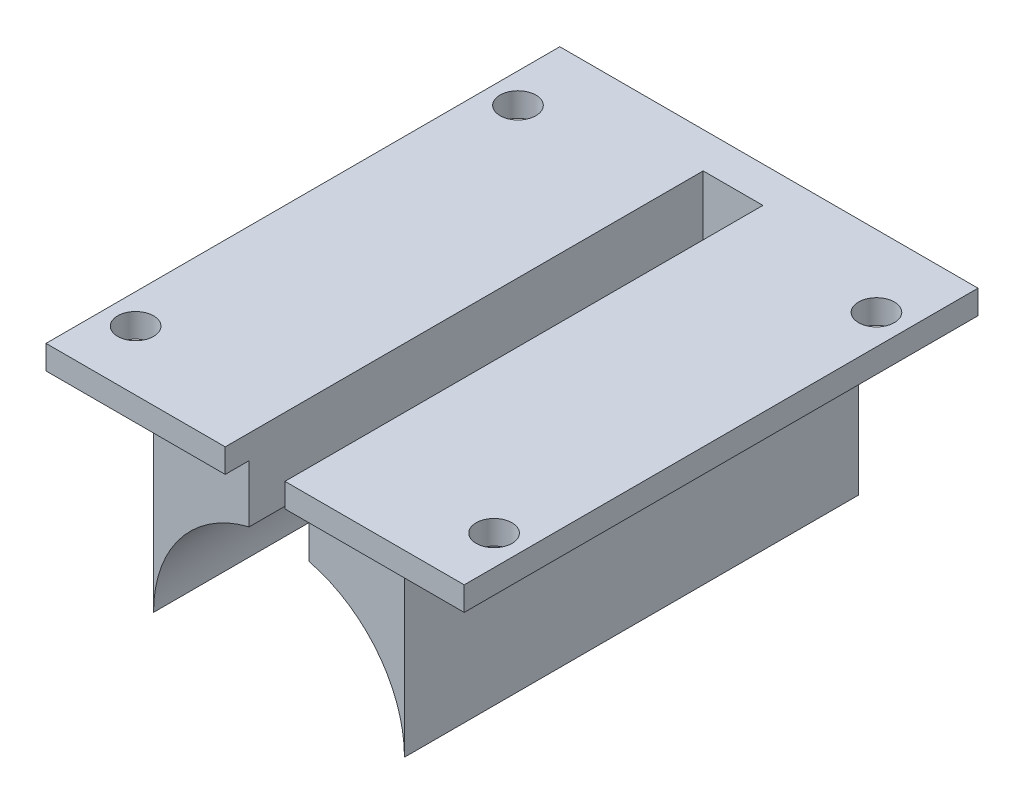
ISO-10303-21;
HEADER;
FILE_DESCRIPTION(('STEP AP214'),'2;1');
FILE_NAME('part.step','',(''),(''),'','','');
FILE_SCHEMA(('AUTOMOTIVE_DESIGN { 1 0 10303 214 1 1 1 1 }'));
ENDSEC;
DATA;
#1=APPLICATION_CONTEXT('core data for automotive mechanical design processes');
#2=APPLICATION_PROTOCOL_DEFINITION('international standard','automotive_design',2000,#1);
#3=PRODUCT_CONTEXT('',#1,'mechanical');
#4=PRODUCT('Part','Part','',(#3));
#5=PRODUCT_RELATED_PRODUCT_CATEGORY('part','',(#4));
#6=PRODUCT_DEFINITION_FORMATION('','',#4);
#7=PRODUCT_DEFINITION_CONTEXT('part definition',#1,'design');
#8=PRODUCT_DEFINITION('design','',#6,#7);
#9=PRODUCT_DEFINITION_SHAPE('','',#8);
#10=(LENGTH_UNIT() NAMED_UNIT(*) SI_UNIT(.MILLI.,.METRE.));
#11=(NAMED_UNIT(*) PLANE_ANGLE_UNIT() SI_UNIT($,.RADIAN.));
#12=(NAMED_UNIT(*) SI_UNIT($,.STERADIAN.) SOLID_ANGLE_UNIT());
#13=UNCERTAINTY_MEASURE_WITH_UNIT(LENGTH_MEASURE(1.E-05),#10,'distance_accuracy_value','');
#14=(GEOMETRIC_REPRESENTATION_CONTEXT(3) GLOBAL_UNCERTAINTY_ASSIGNED_CONTEXT((#13)) GLOBAL_UNIT_ASSIGNED_CONTEXT((#10,
#11,#12)) REPRESENTATION_CONTEXT('',''));
#15=CARTESIAN_POINT('',(0.,0.,0.));
#16=DIRECTION('',(0.,0.,1.));
#17=DIRECTION('',(1.,0.,0.));
#18=AXIS2_PLACEMENT_3D('',#15,#16,#17);
#19=CARTESIAN_POINT('',(0.,15.,0.));
#20=DIRECTION('',(0.,-1.,0.));
#21=DIRECTION('',(0.,0.,-1.));
#22=AXIS2_PLACEMENT_3D('',#19,#20,#21);
#23=PLANE('',#22);
#24=DIRECTION('',(0.,0.,1.));
#25=VECTOR('',#24,1.);
#26=CARTESIAN_POINT('',(3.99699292309558,15.,0.));
#27=LINE('',#26,#25);
#28=CARTESIAN_POINT('',(3.99699292309558,15.,-3.));
#29=VERTEX_POINT('',#28);
#30=CARTESIAN_POINT('',(3.99699292309558,15.,0.));
#31=VERTEX_POINT('',#30);
#32=EDGE_CURVE('E47',#29,#31,#27,.T.);
#33=ORIENTED_EDGE('',*,*,#32,.F.);
#34=DIRECTION('',(-1.,0.,0.));
#35=VECTOR('',#34,1.);
#36=CARTESIAN_POINT('',(-17.5,15.,-3.));
#37=LINE('',#36,#35);
#38=CARTESIAN_POINT('',(17.5,15.,-3.));
#39=VERTEX_POINT('',#38);
#40=EDGE_CURVE('E256',#39,#29,#37,.T.);
#41=ORIENTED_EDGE('',*,*,#40,.F.);
#42=DIRECTION('',(0.,0.,-1.));
#43=VECTOR('',#42,1.);
#44=CARTESIAN_POINT('',(17.5,15.,-3.));
#45=LINE('',#44,#43);
#46=CARTESIAN_POINT('',(17.5,15.,40.));
#47=VERTEX_POINT('',#46);
#48=EDGE_CURVE('E251',#47,#39,#45,.T.);
#49=ORIENTED_EDGE('',*,*,#48,.F.);
#50=DIRECTION('',(1.,0.,0.));
#51=VECTOR('',#50,1.);
#52=CARTESIAN_POINT('',(12.5,15.,40.));
#53=LINE('',#52,#51);
#54=CARTESIAN_POINT('',(2.5,15.,40.));
#55=VERTEX_POINT('',#54);
#56=EDGE_CURVE('E267',#55,#47,#53,.T.);
#57=ORIENTED_EDGE('',*,*,#56,.F.);
#58=DIRECTION('',(0.,0.,1.));
#59=VECTOR('',#58,1.);
#60=CARTESIAN_POINT('',(2.5,15.,0.));
#61=LINE('',#60,#59);
#62=CARTESIAN_POINT('',(2.5,15.,38.));
#63=VERTEX_POINT('',#62);
#64=EDGE_CURVE('E265',#63,#55,#61,.T.);
#65=ORIENTED_EDGE('',*,*,#64,.F.);
#66=DIRECTION('',(-1.,0.,0.));
#67=VECTOR('',#66,1.);
#68=CARTESIAN_POINT('',(0.,15.,38.));
#69=LINE('',#68,#67);
#70=CARTESIAN_POINT('',(10.5,15.,38.));
#71=VERTEX_POINT('',#70);
#72=EDGE_CURVE('E336',#71,#63,#69,.T.);
#73=ORIENTED_EDGE('',*,*,#72,.F.);
#74=DIRECTION('',(0.,0.,-1.));
#75=VECTOR('',#74,1.);
#76=CARTESIAN_POINT('',(10.5,15.,0.));
#77=LINE('',#76,#75);
#78=CARTESIAN_POINT('',(10.5,15.,0.));
#79=VERTEX_POINT('',#78);
#80=EDGE_CURVE('E333',#71,#79,#77,.T.);
#81=ORIENTED_EDGE('',*,*,#80,.T.);
#82=DIRECTION('',(-1.,0.,0.));
#83=VECTOR('',#82,1.);
#84=CARTESIAN_POINT('',(0.,15.,0.));
#85=LINE('',#84,#83);
#86=EDGE_CURVE('E330',#79,#31,#85,.T.);
#87=ORIENTED_EDGE('',*,*,#86,.T.);
#88=EDGE_LOOP('',(#33,#41,#49,#57,#65,#73,#81,#87));
#89=FACE_BOUND('',#88,.T.);
#90=CARTESIAN_POINT('',(15.,15.,3.));
#91=DIRECTION('',(0.,1.,0.));
#92=DIRECTION('',(0.,0.,1.));
#93=AXIS2_PLACEMENT_3D('',#90,#91,#92);
#94=CIRCLE('',#93,1.5);
#95=CARTESIAN_POINT('',(15.,15.,4.5));
#96=VERTEX_POINT('',#95);
#97=EDGE_CURVE('E239',#96,#96,#94,.T.);
#98=ORIENTED_EDGE('',*,*,#97,.T.);
#99=EDGE_LOOP('',(#98));
#100=FACE_BOUND('',#99,.T.);
#101=CARTESIAN_POINT('',(15.0000000000003,15.,35.));
#102=DIRECTION('',(0.,1.,0.));
#103=DIRECTION('',(0.,0.,1.));
#104=AXIS2_PLACEMENT_3D('',#101,#102,#103);
#105=CIRCLE('',#104,1.5);
#106=CARTESIAN_POINT('',(15.0000000000003,15.,36.5));
#107=VERTEX_POINT('',#106);
#108=EDGE_CURVE('E233',#107,#107,#105,.T.);
#109=ORIENTED_EDGE('',*,*,#108,.T.);
#110=EDGE_LOOP('',(#109));
#111=FACE_BOUND('',#110,.T.);
#112=ADVANCED_FACE('F32',(#89,#100,#111),#23,.T.);
#113=CARTESIAN_POINT('',(0.,0.,38.));
#114=DIRECTION('',(0.,0.,-1.));
#115=DIRECTION('',(-1.,0.,0.));
#116=AXIS2_PLACEMENT_3D('',#113,#114,#115);
#117=CYLINDRICAL_SURFACE('',#116,10.5);
#118=CARTESIAN_POINT('',(0.,0.,0.));
#119=DIRECTION('',(0.,0.,-1.));
#120=DIRECTION('',(1.,0.,0.));
#121=AXIS2_PLACEMENT_3D('',#118,#119,#120);
#122=CIRCLE('',#121,10.5);
#123=CARTESIAN_POINT('',(-10.5,0.,0.));
#124=VERTEX_POINT('',#123);
#125=CARTESIAN_POINT('',(-4.,9.7082439194738,0.));
#126=VERTEX_POINT('',#125);
#127=EDGE_CURVE('E307',#124,#126,#122,.T.);
#128=ORIENTED_EDGE('',*,*,#127,.T.);
#129=CARTESIAN_POINT('',(0.,0.,0.));
#130=DIRECTION('',(0.,0.,1.));
#131=DIRECTION('',(1.,0.,0.));
#132=AXIS2_PLACEMENT_3D('',#129,#130,#131);
#133=CIRCLE('',#132,10.5);
#134=CARTESIAN_POINT('',(-2.5,10.1980390271856,0.));
#135=VERTEX_POINT('',#134);
#136=EDGE_CURVE('E202',#126,#135,#133,.F.);
#137=ORIENTED_EDGE('',*,*,#136,.T.);
#138=DIRECTION('',(0.,0.,-1.));
#139=VECTOR('',#138,1.);
#140=CARTESIAN_POINT('',(-2.5,10.1980390271856,38.));
#141=LINE('',#140,#139);
#142=CARTESIAN_POINT('',(-2.5,10.1980390271856,38.));
#143=VERTEX_POINT('',#142);
#144=EDGE_CURVE('E324',#143,#135,#141,.T.);
#145=ORIENTED_EDGE('',*,*,#144,.F.);
#146=CARTESIAN_POINT('',(0.,0.,38.));
#147=DIRECTION('',(0.,0.,-1.));
#148=DIRECTION('',(1.,0.,0.));
#149=AXIS2_PLACEMENT_3D('',#146,#147,#148);
#150=CIRCLE('',#149,10.5);
#151=CARTESIAN_POINT('',(-10.5,0.,38.));
#152=VERTEX_POINT('',#151);
#153=EDGE_CURVE('E308',#152,#143,#150,.T.);
#154=ORIENTED_EDGE('',*,*,#153,.F.);
#155=DIRECTION('',(0.,0.,-1.));
#156=VECTOR('',#155,1.);
#157=CARTESIAN_POINT('',(-10.5,0.,38.));
#158=LINE('',#157,#156);
#159=EDGE_CURVE('E314',#152,#124,#158,.T.);
#160=ORIENTED_EDGE('',*,*,#159,.T.);
#161=EDGE_LOOP('',(#128,#137,#145,#154,#160));
#162=FACE_BOUND('',#161,.T.);
#163=ADVANCED_FACE('F34',(#162),#117,.F.);
#164=CARTESIAN_POINT('',(-2.5,17.,38.));
#165=DIRECTION('',(-1.,0.,0.));
#166=DIRECTION('',(0.,-1.,0.));
#167=AXIS2_PLACEMENT_3D('',#164,#165,#166);
#168=PLANE('',#167);
#169=DIRECTION('',(0.,1.,0.));
#170=VECTOR('',#169,1.);
#171=CARTESIAN_POINT('',(-2.5,17.,0.));
#172=LINE('',#171,#170);
#173=CARTESIAN_POINT('',(-2.5,17.,0.));
#174=VERTEX_POINT('',#173);
#175=EDGE_CURVE('E317',#135,#174,#172,.T.);
#176=ORIENTED_EDGE('',*,*,#175,.T.);
#177=DIRECTION('',(0.,0.,-1.));
#178=VECTOR('',#177,1.);
#179=CARTESIAN_POINT('',(-2.5,17.,38.));
#180=LINE('',#179,#178);
#181=CARTESIAN_POINT('',(-2.5,17.,40.));
#182=VERTEX_POINT('',#181);
#183=EDGE_CURVE('E321',#182,#174,#180,.T.);
#184=ORIENTED_EDGE('',*,*,#183,.F.);
#185=DIRECTION('',(0.,1.,0.));
#186=VECTOR('',#185,1.);
#187=CARTESIAN_POINT('',(-2.5,15.,40.));
#188=LINE('',#187,#186);
#189=CARTESIAN_POINT('',(-2.5,15.,40.));
#190=VERTEX_POINT('',#189);
#191=EDGE_CURVE('E293',#190,#182,#188,.T.);
#192=ORIENTED_EDGE('',*,*,#191,.F.);
#193=DIRECTION('',(0.,0.,-1.));
#194=VECTOR('',#193,1.);
#195=CARTESIAN_POINT('',(-2.5,15.,0.));
#196=LINE('',#195,#194);
#197=CARTESIAN_POINT('',(-2.5,15.,38.));
#198=VERTEX_POINT('',#197);
#199=EDGE_CURVE('E262',#190,#198,#196,.T.);
#200=ORIENTED_EDGE('',*,*,#199,.T.);
#201=DIRECTION('',(0.,1.,0.));
#202=VECTOR('',#201,1.);
#203=CARTESIAN_POINT('',(-2.5,17.,38.));
#204=LINE('',#203,#202);
#205=EDGE_CURVE('E310',#143,#198,#204,.T.);
#206=ORIENTED_EDGE('',*,*,#205,.F.);
#207=ORIENTED_EDGE('',*,*,#144,.T.);
#208=EDGE_LOOP('',(#176,#184,#192,#200,#206,#207));
#209=FACE_BOUND('',#208,.T.);
#210=ADVANCED_FACE('F382',(#209),#168,.F.);
#211=CARTESIAN_POINT('',(-2.5,17.,38.));
#212=DIRECTION('',(0.,-1.,0.));
#213=DIRECTION('',(0.,0.,-1.));
#214=AXIS2_PLACEMENT_3D('',#211,#212,#213);
#215=PLANE('',#214);
#216=ORIENTED_EDGE('',*,*,#183,.T.);
#217=DIRECTION('',(1.,0.,0.));
#218=VECTOR('',#217,1.);
#219=CARTESIAN_POINT('',(2.5,17.,0.));
#220=LINE('',#219,#218);
#221=CARTESIAN_POINT('',(2.5,17.,0.));
#222=VERTEX_POINT('',#221);
#223=EDGE_CURVE('E277',#174,#222,#220,.T.);
#224=ORIENTED_EDGE('',*,*,#223,.T.);
#225=DIRECTION('',(0.,0.,1.));
#226=VECTOR('',#225,1.);
#227=CARTESIAN_POINT('',(2.5,17.,0.));
#228=LINE('',#227,#226);
#229=CARTESIAN_POINT('',(2.5,17.,40.));
#230=VERTEX_POINT('',#229);
#231=EDGE_CURVE('E280',#222,#230,#228,.T.);
#232=ORIENTED_EDGE('',*,*,#231,.T.);
#233=DIRECTION('',(1.,0.,0.));
#234=VECTOR('',#233,1.);
#235=CARTESIAN_POINT('',(17.5,17.,40.));
#236=LINE('',#235,#234);
#237=CARTESIAN_POINT('',(17.5,17.,40.));
#238=VERTEX_POINT('',#237);
#239=EDGE_CURVE('E282',#230,#238,#236,.T.);
#240=ORIENTED_EDGE('',*,*,#239,.T.);
#241=DIRECTION('',(0.,0.,-1.));
#242=VECTOR('',#241,1.);
#243=CARTESIAN_POINT('',(17.5,17.,-2.));
#244=LINE('',#243,#242);
#245=CARTESIAN_POINT('',(17.5,17.,-3.));
#246=VERTEX_POINT('',#245);
#247=EDGE_CURVE('E255',#238,#246,#244,.T.);
#248=ORIENTED_EDGE('',*,*,#247,.T.);
#249=DIRECTION('',(-1.,0.,0.));
#250=VECTOR('',#249,1.);
#251=CARTESIAN_POINT('',(-17.5,17.,-3.));
#252=LINE('',#251,#250);
#253=CARTESIAN_POINT('',(-17.5,17.,-3.));
#254=VERTEX_POINT('',#253);
#255=EDGE_CURVE('E248',#246,#254,#252,.T.);
#256=ORIENTED_EDGE('',*,*,#255,.T.);
#257=DIRECTION('',(0.,0.,1.));
#258=VECTOR('',#257,1.);
#259=CARTESIAN_POINT('',(-17.5,17.,40.));
#260=LINE('',#259,#258);
#261=CARTESIAN_POINT('',(-17.5,17.,40.));
#262=VERTEX_POINT('',#261);
#263=EDGE_CURVE('E271',#254,#262,#260,.T.);
#264=ORIENTED_EDGE('',*,*,#263,.T.);
#265=DIRECTION('',(1.,0.,0.));
#266=VECTOR('',#265,1.);
#267=CARTESIAN_POINT('',(-2.5,17.,40.));
#268=LINE('',#267,#266);
#269=EDGE_CURVE('E274',#262,#182,#268,.T.);
#270=ORIENTED_EDGE('',*,*,#269,.T.);
#271=EDGE_LOOP('',(#216,#224,#232,#240,#248,#256,#264,#270));
#272=FACE_BOUND('',#271,.T.);
#273=CARTESIAN_POINT('',(-14.9999999999997,17.,35.));
#274=DIRECTION('',(0.,1.,0.));
#275=DIRECTION('',(0.,0.,1.));
#276=AXIS2_PLACEMENT_3D('',#273,#274,#275);
#277=CIRCLE('',#276,1.5);
#278=CARTESIAN_POINT('',(-14.9999999999997,17.,36.5));
#279=VERTEX_POINT('',#278);
#280=EDGE_CURVE('E226',#279,#279,#277,.T.);
#281=ORIENTED_EDGE('',*,*,#280,.F.);
#282=EDGE_LOOP('',(#281));
#283=FACE_BOUND('',#282,.T.);
#284=CARTESIAN_POINT('',(-15.,17.,3.));
#285=DIRECTION('',(0.,1.,0.));
#286=DIRECTION('',(0.,0.,1.));
#287=AXIS2_PLACEMENT_3D('',#284,#285,#286);
#288=CIRCLE('',#287,1.5);
#289=CARTESIAN_POINT('',(-15.,17.,4.5));
#290=VERTEX_POINT('',#289);
#291=EDGE_CURVE('E242',#290,#290,#288,.T.);
#292=ORIENTED_EDGE('',*,*,#291,.F.);
#293=EDGE_LOOP('',(#292));
#294=FACE_BOUND('',#293,.T.);
#295=CARTESIAN_POINT('',(15.,17.,3.));
#296=DIRECTION('',(0.,1.,0.));
#297=DIRECTION('',(0.,0.,1.));
#298=AXIS2_PLACEMENT_3D('',#295,#296,#297);
#299=CIRCLE('',#298,1.5);
#300=CARTESIAN_POINT('',(15.,17.,4.5));
#301=VERTEX_POINT('',#300);
#302=EDGE_CURVE('E236',#301,#301,#299,.T.);
#303=ORIENTED_EDGE('',*,*,#302,.F.);
#304=EDGE_LOOP('',(#303));
#305=FACE_BOUND('',#304,.T.);
#306=CARTESIAN_POINT('',(15.0000000000003,17.,35.));
#307=DIRECTION('',(0.,1.,0.));
#308=DIRECTION('',(0.,0.,1.));
#309=AXIS2_PLACEMENT_3D('',#306,#307,#308);
#310=CIRCLE('',#309,1.5);
#311=CARTESIAN_POINT('',(15.0000000000003,17.,36.5));
#312=VERTEX_POINT('',#311);
#313=EDGE_CURVE('E230',#312,#312,#310,.T.);
#314=ORIENTED_EDGE('',*,*,#313,.F.);
#315=EDGE_LOOP('',(#314));
#316=FACE_BOUND('',#315,.T.);
#317=ADVANCED_FACE('F403',(#272,#283,#294,#305,#316),#215,.F.);
#318=CARTESIAN_POINT('',(-10.5,0.,38.));
#319=DIRECTION('',(1.,0.,0.));
#320=DIRECTION('',(0.,1.,0.));
#321=AXIS2_PLACEMENT_3D('',#318,#319,#320);
#322=PLANE('',#321);
#323=DIRECTION('',(0.,-1.,0.));
#324=VECTOR('',#323,1.);
#325=CARTESIAN_POINT('',(-10.5,17.,38.));
#326=LINE('',#325,#324);
#327=CARTESIAN_POINT('',(-10.5,15.,38.));
#328=VERTEX_POINT('',#327);
#329=EDGE_CURVE('E56',#328,#152,#326,.T.);
#330=ORIENTED_EDGE('',*,*,#329,.F.);
#331=DIRECTION('',(0.,0.,-1.));
#332=VECTOR('',#331,1.);
#333=CARTESIAN_POINT('',(-10.5,15.,38.));
#334=LINE('',#333,#332);
#335=CARTESIAN_POINT('',(-10.5,15.,0.));
#336=VERTEX_POINT('',#335);
#337=EDGE_CURVE('E74',#328,#336,#334,.T.);
#338=ORIENTED_EDGE('',*,*,#337,.T.);
#339=DIRECTION('',(0.,-1.,0.));
#340=VECTOR('',#339,1.);
#341=CARTESIAN_POINT('',(-10.5,0.,0.));
#342=LINE('',#341,#340);
#343=EDGE_CURVE('E67',#336,#124,#342,.T.);
#344=ORIENTED_EDGE('',*,*,#343,.T.);
#345=ORIENTED_EDGE('',*,*,#159,.F.);
#346=EDGE_LOOP('',(#330,#338,#344,#345));
#347=FACE_BOUND('',#346,.T.);
#348=ADVANCED_FACE('F406',(#347),#322,.F.);
#349=CARTESIAN_POINT('',(0.,0.,38.));
#350=DIRECTION('',(0.,0.,1.));
#351=DIRECTION('',(1.,0.,0.));
#352=AXIS2_PLACEMENT_3D('',#349,#350,#351);
#353=PLANE('',#352);
#354=DIRECTION('',(1.,0.,0.));
#355=VECTOR('',#354,1.);
#356=CARTESIAN_POINT('',(0.,15.,38.));
#357=LINE('',#356,#355);
#358=EDGE_CURVE('E305',#328,#198,#357,.T.);
#359=ORIENTED_EDGE('',*,*,#358,.F.);
#360=ORIENTED_EDGE('',*,*,#329,.T.);
#361=ORIENTED_EDGE('',*,*,#153,.T.);
#362=ORIENTED_EDGE('',*,*,#205,.T.);
#363=EDGE_LOOP('',(#359,#360,#361,#362));
#364=FACE_BOUND('',#363,.T.);
#365=ADVANCED_FACE('F530',(#364),#353,.T.);
#366=CARTESIAN_POINT('',(0.,0.,0.));
#367=DIRECTION('',(0.,0.,1.));
#368=DIRECTION('',(1.,0.,0.));
#369=AXIS2_PLACEMENT_3D('',#366,#367,#368);
#370=PLANE('',#369);
#371=DIRECTION('',(1.,0.,0.));
#372=VECTOR('',#371,1.);
#373=CARTESIAN_POINT('',(0.,15.,0.));
#374=LINE('',#373,#372);
#375=CARTESIAN_POINT('',(-4.,15.,0.));
#376=VERTEX_POINT('',#375);
#377=EDGE_CURVE('E327',#336,#376,#374,.T.);
#378=ORIENTED_EDGE('',*,*,#377,.T.);
#379=DIRECTION('',(0.,1.,0.));
#380=VECTOR('',#379,1.);
#381=CARTESIAN_POINT('',(-4.,0.,0.));
#382=LINE('',#381,#380);
#383=EDGE_CURVE('E195',#126,#376,#382,.T.);
#384=ORIENTED_EDGE('',*,*,#383,.F.);
#385=ORIENTED_EDGE('',*,*,#127,.F.);
#386=ORIENTED_EDGE('',*,*,#343,.F.);
#387=EDGE_LOOP('',(#378,#384,#385,#386));
#388=FACE_BOUND('',#387,.T.);
#389=ADVANCED_FACE('F523',(#388),#370,.F.);
#390=CARTESIAN_POINT('',(17.5,15.,-2.));
#391=DIRECTION('',(1.,0.,0.));
#392=DIRECTION('',(0.,0.,-1.));
#393=AXIS2_PLACEMENT_3D('',#390,#391,#392);
#394=PLANE('',#393);
#395=ORIENTED_EDGE('',*,*,#247,.F.);
#396=DIRECTION('',(0.,1.,0.));
#397=VECTOR('',#396,1.);
#398=CARTESIAN_POINT('',(17.5,15.,40.));
#399=LINE('',#398,#397);
#400=EDGE_CURVE('E286',#47,#238,#399,.T.);
#401=ORIENTED_EDGE('',*,*,#400,.F.);
#402=ORIENTED_EDGE('',*,*,#48,.T.);
#403=DIRECTION('',(0.,1.,0.));
#404=VECTOR('',#403,1.);
#405=CARTESIAN_POINT('',(17.5,15.,-3.));
#406=LINE('',#405,#404);
#407=EDGE_CURVE('E269',#39,#246,#406,.T.);
#408=ORIENTED_EDGE('',*,*,#407,.T.);
#409=EDGE_LOOP('',(#395,#401,#402,#408));
#410=FACE_BOUND('',#409,.T.);
#411=ADVANCED_FACE('F511',(#410),#394,.T.);
#412=CARTESIAN_POINT('',(17.5,15.,40.));
#413=DIRECTION('',(0.,0.,1.));
#414=DIRECTION('',(1.,0.,0.));
#415=AXIS2_PLACEMENT_3D('',#412,#413,#414);
#416=PLANE('',#415);
#417=ORIENTED_EDGE('',*,*,#239,.F.);
#418=DIRECTION('',(0.,1.,0.));
#419=VECTOR('',#418,1.);
#420=CARTESIAN_POINT('',(2.5,15.,40.));
#421=LINE('',#420,#419);
#422=EDGE_CURVE('E288',#55,#230,#421,.T.);
#423=ORIENTED_EDGE('',*,*,#422,.F.);
#424=ORIENTED_EDGE('',*,*,#56,.T.);
#425=ORIENTED_EDGE('',*,*,#400,.T.);
#426=EDGE_LOOP('',(#417,#423,#424,#425));
#427=FACE_BOUND('',#426,.T.);
#428=ADVANCED_FACE('F506',(#427),#416,.T.);
#429=CARTESIAN_POINT('',(2.5,15.,0.));
#430=DIRECTION('',(-1.,0.,0.));
#431=DIRECTION('',(0.,0.,1.));
#432=AXIS2_PLACEMENT_3D('',#429,#430,#431);
#433=PLANE('',#432);
#434=ORIENTED_EDGE('',*,*,#422,.T.);
#435=ORIENTED_EDGE('',*,*,#231,.F.);
#436=DIRECTION('',(0.,1.,0.));
#437=VECTOR('',#436,1.);
#438=CARTESIAN_POINT('',(2.5,15.,0.));
#439=LINE('',#438,#437);
#440=CARTESIAN_POINT('',(2.5,10.1980390271856,0.));
#441=VERTEX_POINT('',#440);
#442=EDGE_CURVE('E291',#441,#222,#439,.T.);
#443=ORIENTED_EDGE('',*,*,#442,.F.);
#444=DIRECTION('',(0.,0.,-1.));
#445=VECTOR('',#444,1.);
#446=CARTESIAN_POINT('',(2.5,10.1980390271856,38.));
#447=LINE('',#446,#445);
#448=CARTESIAN_POINT('',(2.5,10.1980390271856,38.));
#449=VERTEX_POINT('',#448);
#450=EDGE_CURVE('E215',#449,#441,#447,.T.);
#451=ORIENTED_EDGE('',*,*,#450,.F.);
#452=DIRECTION('',(0.,-1.,0.));
#453=VECTOR('',#452,1.);
#454=CARTESIAN_POINT('',(2.5,17.,38.));
#455=LINE('',#454,#453);
#456=EDGE_CURVE('E213',#63,#449,#455,.T.);
#457=ORIENTED_EDGE('',*,*,#456,.F.);
#458=ORIENTED_EDGE('',*,*,#64,.T.);
#459=EDGE_LOOP('',(#434,#435,#443,#451,#457,#458));
#460=FACE_BOUND('',#459,.T.);
#461=ADVANCED_FACE('F455',(#460),#433,.T.);
#462=CARTESIAN_POINT('',(2.5,15.,0.));
#463=DIRECTION('',(0.,0.,1.));
#464=DIRECTION('',(1.,0.,0.));
#465=AXIS2_PLACEMENT_3D('',#462,#463,#464);
#466=PLANE('',#465);
#467=CARTESIAN_POINT('',(0.,0.,0.));
#468=DIRECTION('',(0.,0.,1.));
#469=DIRECTION('',(1.,0.,0.));
#470=AXIS2_PLACEMENT_3D('',#467,#468,#469);
#471=CIRCLE('',#470,4.);
#472=CARTESIAN_POINT('',(3.99699292309558,0.155072798142922,0.));
#473=VERTEX_POINT('',#472);
#474=CARTESIAN_POINT('',(-4.,0.,0.));
#475=VERTEX_POINT('',#474);
#476=EDGE_CURVE('E177',#473,#475,#471,.T.);
#477=ORIENTED_EDGE('',*,*,#476,.F.);
#478=DIRECTION('',(0.,1.,0.));
#479=VECTOR('',#478,1.);
#480=CARTESIAN_POINT('',(3.99699292309558,0.,0.));
#481=LINE('',#480,#479);
#482=CARTESIAN_POINT('',(3.99699292309558,9.70948235348949,0.));
#483=VERTEX_POINT('',#482);
#484=EDGE_CURVE('E362',#473,#483,#481,.T.);
#485=ORIENTED_EDGE('',*,*,#484,.T.);
#486=CARTESIAN_POINT('',(0.,0.,0.));
#487=DIRECTION('',(0.,0.,-1.));
#488=DIRECTION('',(1.,0.,0.));
#489=AXIS2_PLACEMENT_3D('',#486,#487,#488);
#490=CIRCLE('',#489,10.5);
#491=EDGE_CURVE('E216',#441,#483,#490,.T.);
#492=ORIENTED_EDGE('',*,*,#491,.F.);
#493=ORIENTED_EDGE('',*,*,#442,.T.);
#494=ORIENTED_EDGE('',*,*,#223,.F.);
#495=ORIENTED_EDGE('',*,*,#175,.F.);
#496=ORIENTED_EDGE('',*,*,#136,.F.);
#497=EDGE_CURVE('E197',#475,#126,#382,.T.);
#498=ORIENTED_EDGE('',*,*,#497,.F.);
#499=EDGE_LOOP('',(#477,#485,#492,#493,#494,#495,#496,#498));
#500=FACE_BOUND('',#499,.T.);
#501=ADVANCED_FACE('F359',(#500),#466,.T.);
#502=CARTESIAN_POINT('',(-2.5,15.,40.));
#503=DIRECTION('',(0.,0.,1.));
#504=DIRECTION('',(1.,0.,0.));
#505=AXIS2_PLACEMENT_3D('',#502,#503,#504);
#506=PLANE('',#505);
#507=ORIENTED_EDGE('',*,*,#269,.F.);
#508=DIRECTION('',(0.,1.,0.));
#509=VECTOR('',#508,1.);
#510=CARTESIAN_POINT('',(-17.5,15.,40.));
#511=LINE('',#510,#509);
#512=CARTESIAN_POINT('',(-17.5,15.,40.));
#513=VERTEX_POINT('',#512);
#514=EDGE_CURVE('E296',#513,#262,#511,.T.);
#515=ORIENTED_EDGE('',*,*,#514,.F.);
#516=DIRECTION('',(1.,0.,0.));
#517=VECTOR('',#516,1.);
#518=CARTESIAN_POINT('',(-12.5,15.,40.));
#519=LINE('',#518,#517);
#520=EDGE_CURVE('E260',#513,#190,#519,.T.);
#521=ORIENTED_EDGE('',*,*,#520,.T.);
#522=ORIENTED_EDGE('',*,*,#191,.T.);
#523=EDGE_LOOP('',(#507,#515,#521,#522));
#524=FACE_BOUND('',#523,.T.);
#525=ADVANCED_FACE('F454',(#524),#506,.T.);
#526=CARTESIAN_POINT('',(-17.5,15.,40.));
#527=DIRECTION('',(-1.,0.,0.));
#528=DIRECTION('',(0.,0.,1.));
#529=AXIS2_PLACEMENT_3D('',#526,#527,#528);
#530=PLANE('',#529);
#531=ORIENTED_EDGE('',*,*,#263,.F.);
#532=DIRECTION('',(0.,1.,0.));
#533=VECTOR('',#532,1.);
#534=CARTESIAN_POINT('',(-17.5,15.,-3.));
#535=LINE('',#534,#533);
#536=CARTESIAN_POINT('',(-17.5,15.,-3.));
#537=VERTEX_POINT('',#536);
#538=EDGE_CURVE('E299',#537,#254,#535,.T.);
#539=ORIENTED_EDGE('',*,*,#538,.F.);
#540=DIRECTION('',(0.,0.,1.));
#541=VECTOR('',#540,1.);
#542=CARTESIAN_POINT('',(-17.5,15.,-2.));
#543=LINE('',#542,#541);
#544=EDGE_CURVE('E258',#537,#513,#543,.T.);
#545=ORIENTED_EDGE('',*,*,#544,.T.);
#546=ORIENTED_EDGE('',*,*,#514,.T.);
#547=EDGE_LOOP('',(#531,#539,#545,#546));
#548=FACE_BOUND('',#547,.T.);
#549=ADVANCED_FACE('F394',(#548),#530,.T.);
#550=CARTESIAN_POINT('',(-17.5,15.,-3.));
#551=DIRECTION('',(0.,0.,-1.));
#552=DIRECTION('',(-1.,0.,0.));
#553=AXIS2_PLACEMENT_3D('',#550,#551,#552);
#554=PLANE('',#553);
#555=CARTESIAN_POINT('',(0.,0.,-3.));
#556=DIRECTION('',(0.,0.,-1.));
#557=DIRECTION('',(-1.,0.,0.));
#558=AXIS2_PLACEMENT_3D('',#555,#556,#557);
#559=CIRCLE('',#558,4.);
#560=CARTESIAN_POINT('',(-4.,0.,-3.));
#561=VERTEX_POINT('',#560);
#562=CARTESIAN_POINT('',(3.99699292309558,0.155072798142922,-3.));
#563=VERTEX_POINT('',#562);
#564=EDGE_CURVE('E174',#561,#563,#559,.T.);
#565=ORIENTED_EDGE('',*,*,#564,.F.);
#566=DIRECTION('',(0.,1.,0.));
#567=VECTOR('',#566,1.);
#568=CARTESIAN_POINT('',(-4.,0.,-3.));
#569=LINE('',#568,#567);
#570=CARTESIAN_POINT('',(-4.,15.,-3.));
#571=VERTEX_POINT('',#570);
#572=EDGE_CURVE('E182',#561,#571,#569,.T.);
#573=ORIENTED_EDGE('',*,*,#572,.T.);
#574=EDGE_CURVE('E254',#571,#537,#37,.T.);
#575=ORIENTED_EDGE('',*,*,#574,.T.);
#576=ORIENTED_EDGE('',*,*,#538,.T.);
#577=ORIENTED_EDGE('',*,*,#255,.F.);
#578=ORIENTED_EDGE('',*,*,#407,.F.);
#579=ORIENTED_EDGE('',*,*,#40,.T.);
#580=DIRECTION('',(0.,1.,0.));
#581=VECTOR('',#580,1.);
#582=CARTESIAN_POINT('',(3.99699292309558,0.,-3.));
#583=LINE('',#582,#581);
#584=EDGE_CURVE('E191',#563,#29,#583,.T.);
#585=ORIENTED_EDGE('',*,*,#584,.F.);
#586=EDGE_LOOP('',(#565,#573,#575,#576,#577,#578,#579,#585));
#587=FACE_BOUND('',#586,.T.);
#588=ADVANCED_FACE('F188',(#587),#554,.T.);
#589=DIRECTION('',(0.,0.,-1.));
#590=VECTOR('',#589,1.);
#591=CARTESIAN_POINT('',(-4.,15.,0.));
#592=LINE('',#591,#590);
#593=EDGE_CURVE('E11',#376,#571,#592,.T.);
#594=ORIENTED_EDGE('',*,*,#593,.F.);
#595=ORIENTED_EDGE('',*,*,#377,.F.);
#596=ORIENTED_EDGE('',*,*,#337,.F.);
#597=ORIENTED_EDGE('',*,*,#358,.T.);
#598=ORIENTED_EDGE('',*,*,#199,.F.);
#599=ORIENTED_EDGE('',*,*,#520,.F.);
#600=ORIENTED_EDGE('',*,*,#544,.F.);
#601=ORIENTED_EDGE('',*,*,#574,.F.);
#602=EDGE_LOOP('',(#594,#595,#596,#597,#598,#599,#600,#601));
#603=FACE_BOUND('',#602,.T.);
#604=CARTESIAN_POINT('',(-14.9999999999997,15.,35.));
#605=DIRECTION('',(0.,1.,0.));
#606=DIRECTION('',(0.,0.,1.));
#607=AXIS2_PLACEMENT_3D('',#604,#605,#606);
#608=CIRCLE('',#607,1.5);
#609=CARTESIAN_POINT('',(-14.9999999999997,15.,36.5));
#610=VERTEX_POINT('',#609);
#611=EDGE_CURVE('E227',#610,#610,#608,.T.);
#612=ORIENTED_EDGE('',*,*,#611,.T.);
#613=EDGE_LOOP('',(#612));
#614=FACE_BOUND('',#613,.T.);
#615=CARTESIAN_POINT('',(-15.,15.,3.));
#616=DIRECTION('',(0.,1.,0.));
#617=DIRECTION('',(0.,0.,1.));
#618=AXIS2_PLACEMENT_3D('',#615,#616,#617);
#619=CIRCLE('',#618,1.5);
#620=CARTESIAN_POINT('',(-15.,15.,4.5));
#621=VERTEX_POINT('',#620);
#622=EDGE_CURVE('E245',#621,#621,#619,.T.);
#623=ORIENTED_EDGE('',*,*,#622,.T.);
#624=EDGE_LOOP('',(#623));
#625=FACE_BOUND('',#624,.T.);
#626=ADVANCED_FACE('F378',(#603,#614,#625),#23,.T.);
#627=CARTESIAN_POINT('',(-15.,15.,3.));
#628=DIRECTION('',(0.,1.,0.));
#629=DIRECTION('',(0.,0.,1.));
#630=AXIS2_PLACEMENT_3D('',#627,#628,#629);
#631=CYLINDRICAL_SURFACE('',#630,1.5);
#632=ORIENTED_EDGE('',*,*,#622,.F.);
#633=EDGE_LOOP('',(#632));
#634=FACE_BOUND('',#633,.T.);
#635=ORIENTED_EDGE('',*,*,#291,.T.);
#636=EDGE_LOOP('',(#635));
#637=FACE_BOUND('',#636,.T.);
#638=ADVANCED_FACE('F387',(#634,#637),#631,.F.);
#639=CARTESIAN_POINT('',(15.,15.,3.));
#640=DIRECTION('',(0.,1.,0.));
#641=DIRECTION('',(0.,0.,1.));
#642=AXIS2_PLACEMENT_3D('',#639,#640,#641);
#643=CYLINDRICAL_SURFACE('',#642,1.5);
#644=ORIENTED_EDGE('',*,*,#97,.F.);
#645=EDGE_LOOP('',(#644));
#646=FACE_BOUND('',#645,.T.);
#647=ORIENTED_EDGE('',*,*,#302,.T.);
#648=EDGE_LOOP('',(#647));
#649=FACE_BOUND('',#648,.T.);
#650=ADVANCED_FACE('F392',(#646,#649),#643,.F.);
#651=CARTESIAN_POINT('',(15.0000000000003,15.,35.));
#652=DIRECTION('',(0.,1.,0.));
#653=DIRECTION('',(0.,0.,1.));
#654=AXIS2_PLACEMENT_3D('',#651,#652,#653);
#655=CYLINDRICAL_SURFACE('',#654,1.5);
#656=ORIENTED_EDGE('',*,*,#108,.F.);
#657=EDGE_LOOP('',(#656));
#658=FACE_BOUND('',#657,.T.);
#659=ORIENTED_EDGE('',*,*,#313,.T.);
#660=EDGE_LOOP('',(#659));
#661=FACE_BOUND('',#660,.T.);
#662=ADVANCED_FACE('F413',(#658,#661),#655,.F.);
#663=CARTESIAN_POINT('',(-14.9999999999997,15.,35.));
#664=DIRECTION('',(0.,1.,0.));
#665=DIRECTION('',(0.,0.,1.));
#666=AXIS2_PLACEMENT_3D('',#663,#664,#665);
#667=CYLINDRICAL_SURFACE('',#666,1.5);
#668=ORIENTED_EDGE('',*,*,#611,.F.);
#669=EDGE_LOOP('',(#668));
#670=FACE_BOUND('',#669,.T.);
#671=ORIENTED_EDGE('',*,*,#280,.T.);
#672=EDGE_LOOP('',(#671));
#673=FACE_BOUND('',#672,.T.);
#674=ADVANCED_FACE('F415',(#670,#673),#667,.F.);
#675=CARTESIAN_POINT('',(0.,0.,38.));
#676=DIRECTION('',(0.,0.,-1.));
#677=DIRECTION('',(-1.,0.,0.));
#678=AXIS2_PLACEMENT_3D('',#675,#676,#677);
#679=CYLINDRICAL_SURFACE('',#678,10.5);
#680=ORIENTED_EDGE('',*,*,#491,.T.);
#681=CARTESIAN_POINT('',(10.5,0.,0.));
#682=VERTEX_POINT('',#681);
#683=EDGE_CURVE('E205',#483,#682,#490,.T.);
#684=ORIENTED_EDGE('',*,*,#683,.T.);
#685=DIRECTION('',(0.,0.,-1.));
#686=VECTOR('',#685,1.);
#687=CARTESIAN_POINT('',(10.5,0.,38.));
#688=LINE('',#687,#686);
#689=CARTESIAN_POINT('',(10.5,0.,38.));
#690=VERTEX_POINT('',#689);
#691=EDGE_CURVE('E223',#690,#682,#688,.T.);
#692=ORIENTED_EDGE('',*,*,#691,.F.);
#693=CARTESIAN_POINT('',(0.,0.,38.));
#694=DIRECTION('',(0.,0.,-1.));
#695=DIRECTION('',(1.,0.,0.));
#696=AXIS2_PLACEMENT_3D('',#693,#694,#695);
#697=CIRCLE('',#696,10.5);
#698=EDGE_CURVE('E206',#449,#690,#697,.T.);
#699=ORIENTED_EDGE('',*,*,#698,.F.);
#700=ORIENTED_EDGE('',*,*,#450,.T.);
#701=EDGE_LOOP('',(#680,#684,#692,#699,#700));
#702=FACE_BOUND('',#701,.T.);
#703=ADVANCED_FACE('F356',(#702),#679,.F.);
#704=CARTESIAN_POINT('',(10.5,10.5,38.));
#705=DIRECTION('',(-1.,0.,0.));
#706=DIRECTION('',(0.,0.,1.));
#707=AXIS2_PLACEMENT_3D('',#704,#705,#706);
#708=PLANE('',#707);
#709=ORIENTED_EDGE('',*,*,#80,.F.);
#710=DIRECTION('',(0.,1.,0.));
#711=VECTOR('',#710,1.);
#712=CARTESIAN_POINT('',(10.5,0.,38.));
#713=LINE('',#712,#711);
#714=EDGE_CURVE('E209',#690,#71,#713,.T.);
#715=ORIENTED_EDGE('',*,*,#714,.F.);
#716=ORIENTED_EDGE('',*,*,#691,.T.);
#717=DIRECTION('',(0.,1.,0.));
#718=VECTOR('',#717,1.);
#719=CARTESIAN_POINT('',(10.5,10.5,0.));
#720=LINE('',#719,#718);
#721=EDGE_CURVE('E210',#682,#79,#720,.T.);
#722=ORIENTED_EDGE('',*,*,#721,.T.);
#723=EDGE_LOOP('',(#709,#715,#716,#722));
#724=FACE_BOUND('',#723,.T.);
#725=ADVANCED_FACE('F348',(#724),#708,.F.);
#726=CARTESIAN_POINT('',(0.,0.,38.));
#727=DIRECTION('',(0.,0.,1.));
#728=DIRECTION('',(1.,0.,0.));
#729=AXIS2_PLACEMENT_3D('',#726,#727,#728);
#730=PLANE('',#729);
#731=ORIENTED_EDGE('',*,*,#714,.T.);
#732=ORIENTED_EDGE('',*,*,#72,.T.);
#733=ORIENTED_EDGE('',*,*,#456,.T.);
#734=ORIENTED_EDGE('',*,*,#698,.T.);
#735=EDGE_LOOP('',(#731,#732,#733,#734));
#736=FACE_BOUND('',#735,.T.);
#737=ADVANCED_FACE('F350',(#736),#730,.T.);
#738=CARTESIAN_POINT('',(0.,0.,0.));
#739=DIRECTION('',(0.,0.,1.));
#740=DIRECTION('',(1.,0.,0.));
#741=AXIS2_PLACEMENT_3D('',#738,#739,#740);
#742=PLANE('',#741);
#743=ORIENTED_EDGE('',*,*,#683,.F.);
#744=DIRECTION('',(0.,1.,0.));
#745=VECTOR('',#744,1.);
#746=CARTESIAN_POINT('',(3.99699292309558,0.,0.));
#747=LINE('',#746,#745);
#748=EDGE_CURVE('E40',#483,#31,#747,.T.);
#749=ORIENTED_EDGE('',*,*,#748,.T.);
#750=ORIENTED_EDGE('',*,*,#86,.F.);
#751=ORIENTED_EDGE('',*,*,#721,.F.);
#752=EDGE_LOOP('',(#743,#749,#750,#751));
#753=FACE_BOUND('',#752,.T.);
#754=ADVANCED_FACE('F339',(#753),#742,.F.);
#755=CARTESIAN_POINT('',(3.99699292309558,0.,0.));
#756=DIRECTION('',(1.,0.,0.));
#757=DIRECTION('',(0.,0.,-1.));
#758=AXIS2_PLACEMENT_3D('',#755,#756,#757);
#759=PLANE('',#758);
#760=DIRECTION('',(0.,0.,-1.));
#761=VECTOR('',#760,1.);
#762=CARTESIAN_POINT('',(3.99699292309558,0.155072798142922,14.));
#763=LINE('',#762,#761);
#764=EDGE_CURVE('E183',#563,#473,#763,.F.);
#765=ORIENTED_EDGE('',*,*,#764,.F.);
#766=ORIENTED_EDGE('',*,*,#584,.T.);
#767=ORIENTED_EDGE('',*,*,#32,.T.);
#768=ORIENTED_EDGE('',*,*,#748,.F.);
#769=ORIENTED_EDGE('',*,*,#484,.F.);
#770=EDGE_LOOP('',(#765,#766,#767,#768,#769));
#771=FACE_BOUND('',#770,.T.);
#772=ADVANCED_FACE('F366',(#771),#759,.T.);
#773=CARTESIAN_POINT('',(-4.,0.,-3.));
#774=DIRECTION('',(-1.,0.,0.));
#775=DIRECTION('',(0.,0.,1.));
#776=AXIS2_PLACEMENT_3D('',#773,#774,#775);
#777=PLANE('',#776);
#778=ORIENTED_EDGE('',*,*,#383,.T.);
#779=ORIENTED_EDGE('',*,*,#593,.T.);
#780=ORIENTED_EDGE('',*,*,#572,.F.);
#781=DIRECTION('',(0.,0.,1.));
#782=VECTOR('',#781,1.);
#783=CARTESIAN_POINT('',(-4.,0.,-3.));
#784=LINE('',#783,#782);
#785=EDGE_CURVE('E171',#561,#475,#784,.T.);
#786=ORIENTED_EDGE('',*,*,#785,.T.);
#787=ORIENTED_EDGE('',*,*,#497,.T.);
#788=EDGE_LOOP('',(#778,#779,#780,#786,#787));
#789=FACE_BOUND('',#788,.T.);
#790=ADVANCED_FACE('F193',(#789),#777,.T.);
#791=CARTESIAN_POINT('',(0.,0.,14.));
#792=DIRECTION('',(0.,0.,-1.));
#793=DIRECTION('',(-1.,0.,0.));
#794=AXIS2_PLACEMENT_3D('',#791,#792,#793);
#795=CYLINDRICAL_SURFACE('',#794,4.);
#796=ORIENTED_EDGE('',*,*,#764,.T.);
#797=ORIENTED_EDGE('',*,*,#476,.T.);
#798=ORIENTED_EDGE('',*,*,#785,.F.);
#799=ORIENTED_EDGE('',*,*,#564,.T.);
#800=EDGE_LOOP('',(#796,#797,#798,#799));
#801=FACE_BOUND('',#800,.T.);
#802=ADVANCED_FACE('F173',(#801),#795,.F.);
#803=CLOSED_SHELL('',(#112,#163,#210,#317,#348,#365,#389,#411,#428,#461,#501,#525,#549,#588,
#626,#638,#650,#662,#674,#703,#725,#737,#754,#772,#790,#802));
#804=MANIFOLD_SOLID_BREP('B2',#803);
#805=ADVANCED_BREP_SHAPE_REPRESENTATION('',(#18,#804),#14);
#806=SHAPE_DEFINITION_REPRESENTATION(#9,#805);
ENDSEC;
END-ISO-10303-21;
